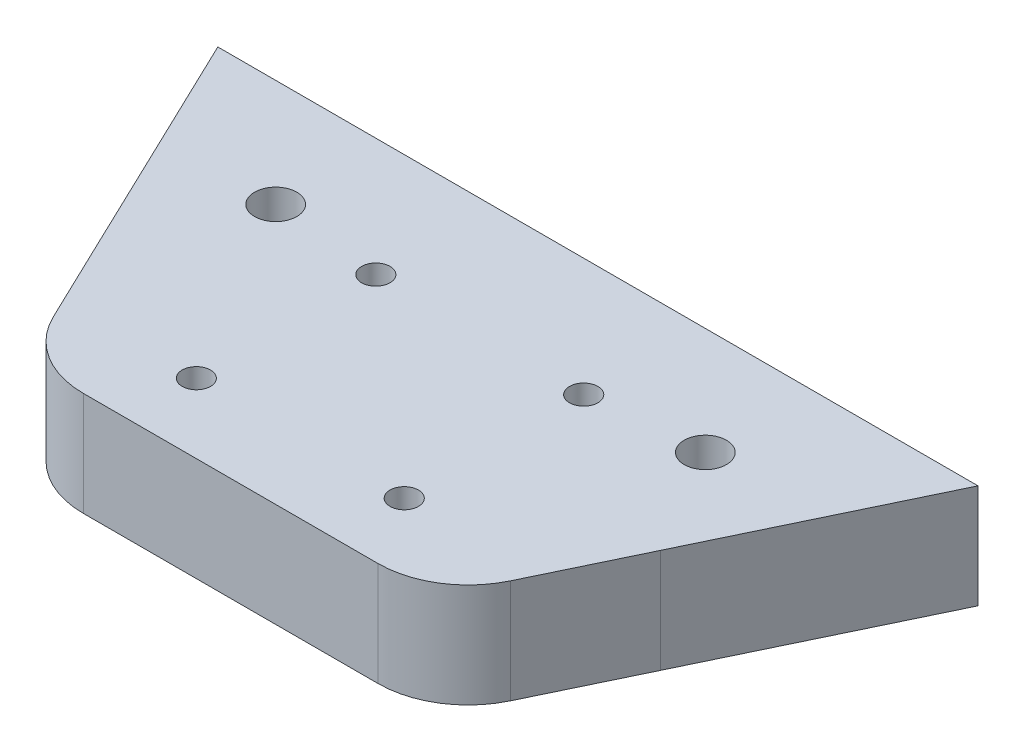
ISO-10303-21;
HEADER;
FILE_DESCRIPTION(('STEP AP214'),'2;1');
FILE_NAME('part.step','',(''),(''),'','','');
FILE_SCHEMA(('AUTOMOTIVE_DESIGN { 1 0 10303 214 1 1 1 1 }'));
ENDSEC;
DATA;
#1=APPLICATION_CONTEXT('core data for automotive mechanical design processes');
#2=APPLICATION_PROTOCOL_DEFINITION('international standard','automotive_design',2000,#1);
#3=PRODUCT_CONTEXT('',#1,'mechanical');
#4=PRODUCT('Part','Part','',(#3));
#5=PRODUCT_RELATED_PRODUCT_CATEGORY('part','',(#4));
#6=PRODUCT_DEFINITION_FORMATION('','',#4);
#7=PRODUCT_DEFINITION_CONTEXT('part definition',#1,'design');
#8=PRODUCT_DEFINITION('design','',#6,#7);
#9=PRODUCT_DEFINITION_SHAPE('','',#8);
#10=(LENGTH_UNIT() NAMED_UNIT(*) SI_UNIT(.MILLI.,.METRE.));
#11=(NAMED_UNIT(*) PLANE_ANGLE_UNIT() SI_UNIT($,.RADIAN.));
#12=(NAMED_UNIT(*) SI_UNIT($,.STERADIAN.) SOLID_ANGLE_UNIT());
#13=UNCERTAINTY_MEASURE_WITH_UNIT(LENGTH_MEASURE(1.E-05),#10,'distance_accuracy_value','');
#14=(GEOMETRIC_REPRESENTATION_CONTEXT(3) GLOBAL_UNCERTAINTY_ASSIGNED_CONTEXT((#13)) GLOBAL_UNIT_ASSIGNED_CONTEXT((#10,
#11,#12)) REPRESENTATION_CONTEXT('',''));
#15=CARTESIAN_POINT('',(0.,0.,0.));
#16=DIRECTION('',(0.,0.,1.));
#17=DIRECTION('',(1.,0.,0.));
#18=AXIS2_PLACEMENT_3D('',#15,#16,#17);
#19=CARTESIAN_POINT('',(40.,15.,15.5));
#20=DIRECTION('',(-1.,0.,0.));
#21=DIRECTION('',(0.,0.,1.));
#22=AXIS2_PLACEMENT_3D('',#19,#20,#21);
#23=PLANE('',#22);
#24=DIRECTION('',(0.,-1.,0.));
#25=VECTOR('',#24,1.);
#26=CARTESIAN_POINT('',(40.,97.9533781461747,15.482152106088));
#27=LINE('',#26,#25);
#28=CARTESIAN_POINT('',(40.,15.,15.482152106088));
#29=VERTEX_POINT('',#28);
#30=CARTESIAN_POINT('',(40.,0.,15.482152106088));
#31=VERTEX_POINT('',#30);
#32=EDGE_CURVE('E51',#29,#31,#27,.T.);
#33=ORIENTED_EDGE('',*,*,#32,.F.);
#34=DIRECTION('',(0.,0.,-1.));
#35=VECTOR('',#34,1.);
#36=CARTESIAN_POINT('',(40.,15.,15.5));
#37=LINE('',#36,#35);
#38=CARTESIAN_POINT('',(39.9957228955692,15.,15.5));
#39=VERTEX_POINT('',#38);
#40=EDGE_CURVE('E254',#39,#29,#37,.T.);
#41=ORIENTED_EDGE('',*,*,#40,.F.);
#42=CARTESIAN_POINT('',(40.,15.,15.5));
#43=DIRECTION('',(0.,-1.,0.));
#44=VECTOR('',#43,1.);
#45=LINE('',#42,#44);
#46=CARTESIAN_POINT('',(39.9957228955692,0.,15.5));
#47=VERTEX_POINT('',#46);
#48=EDGE_CURVE('E44',#39,#47,#45,.T.);
#49=ORIENTED_EDGE('',*,*,#48,.T.);
#50=DIRECTION('',(0.,0.,-1.));
#51=VECTOR('',#50,1.);
#52=CARTESIAN_POINT('',(40.,0.,15.5));
#53=LINE('',#52,#51);
#54=EDGE_CURVE('E125',#47,#31,#53,.T.);
#55=ORIENTED_EDGE('',*,*,#54,.T.);
#56=EDGE_LOOP('',(#33,#41,#49,#55));
#57=FACE_BOUND('',#56,.T.);
#58=ADVANCED_FACE('F35',(#57),#23,.F.);
#59=CARTESIAN_POINT('',(0.,15.,0.));
#60=DIRECTION('',(0.,-1.,0.));
#61=DIRECTION('',(0.,0.,-1.));
#62=AXIS2_PLACEMENT_3D('',#59,#60,#61);
#63=PLANE('',#62);
#64=CARTESIAN_POINT('',(-15.,15.,1.54999999999995));
#65=DIRECTION('',(0.,-1.,0.));
#66=DIRECTION('',(0.,0.,-1.));
#67=AXIS2_PLACEMENT_3D('',#64,#65,#66);
#68=CIRCLE('',#67,2.05);
#69=CARTESIAN_POINT('',(-15.,15.,-0.500000000000043));
#70=VERTEX_POINT('',#69);
#71=EDGE_CURVE('E136',#70,#70,#68,.T.);
#72=ORIENTED_EDGE('',*,*,#71,.T.);
#73=EDGE_LOOP('',(#72));
#74=FACE_BOUND('',#73,.T.);
#75=CARTESIAN_POINT('',(15.,15.,1.54999999999995));
#76=DIRECTION('',(0.,-1.,0.));
#77=DIRECTION('',(0.,0.,-1.));
#78=AXIS2_PLACEMENT_3D('',#75,#76,#77);
#79=CIRCLE('',#78,2.05);
#80=CARTESIAN_POINT('',(15.,15.,-0.500000000000043));
#81=VERTEX_POINT('',#80);
#82=EDGE_CURVE('E436',#81,#81,#79,.T.);
#83=ORIENTED_EDGE('',*,*,#82,.T.);
#84=EDGE_LOOP('',(#83));
#85=FACE_BOUND('',#84,.T.);
#86=ORIENTED_EDGE('',*,*,#40,.T.);
#87=DIRECTION('',(0.432206183170999,0.,-0.901774814035498));
#88=VECTOR('',#87,1.);
#89=CARTESIAN_POINT('',(38.5621224272304,15.,18.4822058565387));
#90=LINE('',#89,#88);
#91=CARTESIAN_POINT('',(54.8492478385724,15.,-15.5));
#92=VERTEX_POINT('',#91);
#93=EDGE_CURVE('E143',#29,#92,#90,.T.);
#94=ORIENTED_EDGE('',*,*,#93,.T.);
#95=DIRECTION('',(-1.,0.,0.));
#96=VECTOR('',#95,1.);
#97=CARTESIAN_POINT('',(-40.,15.,-15.5));
#98=LINE('',#97,#96);
#99=CARTESIAN_POINT('',(-54.8492478385724,15.,-15.5));
#100=VERTEX_POINT('',#99);
#101=EDGE_CURVE('E130',#92,#100,#98,.T.);
#102=ORIENTED_EDGE('',*,*,#101,.T.);
#103=DIRECTION('',(-0.432206183170999,0.,-0.901774814035498));
#104=VECTOR('',#103,1.);
#105=CARTESIAN_POINT('',(-38.5621224272304,15.,18.4822058565387));
#106=LINE('',#105,#104);
#107=CARTESIAN_POINT('',(-40.,15.,15.482152106088));
#108=VERTEX_POINT('',#107);
#109=EDGE_CURVE('E305',#108,#100,#106,.T.);
#110=ORIENTED_EDGE('',*,*,#109,.F.);
#111=DIRECTION('',(0.,0.,1.));
#112=VECTOR('',#111,1.);
#113=CARTESIAN_POINT('',(-40.,15.,15.5));
#114=LINE('',#113,#112);
#115=CARTESIAN_POINT('',(-39.9957228955692,15.,15.5));
#116=VERTEX_POINT('',#115);
#117=EDGE_CURVE('E246',#108,#116,#114,.T.);
#118=ORIENTED_EDGE('',*,*,#117,.T.);
#119=DIRECTION('',(-0.432206183170999,0.,-0.901774814035498));
#120=VECTOR('',#119,1.);
#121=CARTESIAN_POINT('',(-38.5621224272304,15.,18.4822058565387));
#122=LINE('',#121,#120);
#123=CARTESIAN_POINT('',(-32.9849471040766,15.,30.118680381223));
#124=VERTEX_POINT('',#123);
#125=EDGE_CURVE('E179',#124,#116,#122,.T.);
#126=ORIENTED_EDGE('',*,*,#125,.F.);
#127=CARTESIAN_POINT('',(-21.2618745216152,15.,24.5));
#128=DIRECTION('',(0.,-1.,0.));
#129=DIRECTION('',(0.,0.,-1.));
#130=AXIS2_PLACEMENT_3D('',#127,#128,#129);
#131=CIRCLE('',#130,13.);
#132=CARTESIAN_POINT('',(-21.2618745216152,15.,37.5));
#133=VERTEX_POINT('',#132);
#134=EDGE_CURVE('E173',#124,#133,#131,.F.);
#135=ORIENTED_EDGE('',*,*,#134,.T.);
#136=DIRECTION('',(-1.,0.,0.));
#137=VECTOR('',#136,1.);
#138=CARTESIAN_POINT('',(0.,15.,37.5));
#139=LINE('',#138,#137);
#140=CARTESIAN_POINT('',(21.2618745216151,15.,37.5));
#141=VERTEX_POINT('',#140);
#142=EDGE_CURVE('E182',#141,#133,#139,.T.);
#143=ORIENTED_EDGE('',*,*,#142,.F.);
#144=CARTESIAN_POINT('',(21.2618745216151,15.,24.5));
#145=DIRECTION('',(0.,-1.,0.));
#146=DIRECTION('',(0.,0.,-1.));
#147=AXIS2_PLACEMENT_3D('',#144,#145,#146);
#148=CIRCLE('',#147,13.);
#149=CARTESIAN_POINT('',(32.9849471040766,15.,30.118680381223));
#150=VERTEX_POINT('',#149);
#151=EDGE_CURVE('E149',#141,#150,#148,.F.);
#152=ORIENTED_EDGE('',*,*,#151,.T.);
#153=DIRECTION('',(0.432206183170999,0.,-0.901774814035498));
#154=VECTOR('',#153,1.);
#155=CARTESIAN_POINT('',(38.5621224272304,15.,18.4822058565387));
#156=LINE('',#155,#154);
#157=EDGE_CURVE('E175',#150,#39,#156,.T.);
#158=ORIENTED_EDGE('',*,*,#157,.T.);
#159=EDGE_LOOP('',(#86,#94,#102,#110,#118,#126,#135,#143,#152,#158));
#160=FACE_BOUND('',#159,.T.);
#161=CARTESIAN_POINT('',(-31.,15.,0.));
#162=DIRECTION('',(0.,1.,0.));
#163=DIRECTION('',(0.,0.,1.));
#164=AXIS2_PLACEMENT_3D('',#161,#162,#163);
#165=CIRCLE('',#164,3.05);
#166=CARTESIAN_POINT('',(-31.,15.,3.05));
#167=VERTEX_POINT('',#166);
#168=EDGE_CURVE('E266',#167,#167,#165,.T.);
#169=ORIENTED_EDGE('',*,*,#168,.F.);
#170=EDGE_LOOP('',(#169));
#171=FACE_BOUND('',#170,.T.);
#172=CARTESIAN_POINT('',(31.,15.,0.));
#173=DIRECTION('',(0.,1.,0.));
#174=DIRECTION('',(0.,0.,1.));
#175=AXIS2_PLACEMENT_3D('',#172,#173,#174);
#176=CIRCLE('',#175,3.05);
#177=CARTESIAN_POINT('',(31.,15.,3.05));
#178=VERTEX_POINT('',#177);
#179=EDGE_CURVE('E273',#178,#178,#176,.T.);
#180=ORIENTED_EDGE('',*,*,#179,.F.);
#181=EDGE_LOOP('',(#180));
#182=FACE_BOUND('',#181,.T.);
#183=CARTESIAN_POINT('',(-15.,15.,27.45));
#184=DIRECTION('',(0.,-1.,0.));
#185=DIRECTION('',(0.,0.,-1.));
#186=AXIS2_PLACEMENT_3D('',#183,#184,#185);
#187=CIRCLE('',#186,2.05);
#188=CARTESIAN_POINT('',(-15.,15.,25.4));
#189=VERTEX_POINT('',#188);
#190=EDGE_CURVE('E163',#189,#189,#187,.F.);
#191=ORIENTED_EDGE('',*,*,#190,.F.);
#192=EDGE_LOOP('',(#191));
#193=FACE_BOUND('',#192,.T.);
#194=CARTESIAN_POINT('',(15.,15.,27.45));
#195=DIRECTION('',(0.,-1.,0.));
#196=DIRECTION('',(0.,0.,-1.));
#197=AXIS2_PLACEMENT_3D('',#194,#195,#196);
#198=CIRCLE('',#197,2.05);
#199=CARTESIAN_POINT('',(15.,15.,25.4));
#200=VERTEX_POINT('',#199);
#201=EDGE_CURVE('E164',#200,#200,#198,.F.);
#202=ORIENTED_EDGE('',*,*,#201,.F.);
#203=EDGE_LOOP('',(#202));
#204=FACE_BOUND('',#203,.T.);
#205=ADVANCED_FACE('F229',(#74,#85,#160,#171,#182,#193,#204),#63,.F.);
#206=CARTESIAN_POINT('',(0.,0.,0.));
#207=DIRECTION('',(0.,-1.,0.));
#208=DIRECTION('',(0.,0.,-1.));
#209=AXIS2_PLACEMENT_3D('',#206,#207,#208);
#210=PLANE('',#209);
#211=CARTESIAN_POINT('',(-15.,0.,1.54999999999995));
#212=DIRECTION('',(0.,-1.,0.));
#213=DIRECTION('',(0.,0.,-1.));
#214=AXIS2_PLACEMENT_3D('',#211,#212,#213);
#215=CIRCLE('',#214,2.05);
#216=CARTESIAN_POINT('',(-15.,0.,-0.500000000000043));
#217=VERTEX_POINT('',#216);
#218=EDGE_CURVE('E139',#217,#217,#215,.T.);
#219=ORIENTED_EDGE('',*,*,#218,.F.);
#220=EDGE_LOOP('',(#219));
#221=FACE_BOUND('',#220,.T.);
#222=CARTESIAN_POINT('',(15.,0.,1.54999999999995));
#223=DIRECTION('',(0.,-1.,0.));
#224=DIRECTION('',(0.,0.,-1.));
#225=AXIS2_PLACEMENT_3D('',#222,#223,#224);
#226=CIRCLE('',#225,2.05);
#227=CARTESIAN_POINT('',(15.,0.,-0.500000000000043));
#228=VERTEX_POINT('',#227);
#229=EDGE_CURVE('E439',#228,#228,#226,.T.);
#230=ORIENTED_EDGE('',*,*,#229,.F.);
#231=EDGE_LOOP('',(#230));
#232=FACE_BOUND('',#231,.T.);
#233=CARTESIAN_POINT('',(-31.,0.,0.));
#234=DIRECTION('',(0.,1.,0.));
#235=DIRECTION('',(0.,0.,1.));
#236=AXIS2_PLACEMENT_3D('',#233,#234,#235);
#237=CIRCLE('',#236,3.05);
#238=CARTESIAN_POINT('',(-31.,0.,3.05));
#239=VERTEX_POINT('',#238);
#240=EDGE_CURVE('E269',#239,#239,#237,.T.);
#241=ORIENTED_EDGE('',*,*,#240,.T.);
#242=EDGE_LOOP('',(#241));
#243=FACE_BOUND('',#242,.T.);
#244=ORIENTED_EDGE('',*,*,#54,.F.);
#245=DIRECTION('',(-0.432206183170999,0.,0.901774814035498));
#246=VECTOR('',#245,1.);
#247=CARTESIAN_POINT('',(38.5621224272304,0.,18.4822058565387));
#248=LINE('',#247,#246);
#249=CARTESIAN_POINT('',(32.9849471040766,0.,30.118680381223));
#250=VERTEX_POINT('',#249);
#251=EDGE_CURVE('E150',#47,#250,#248,.T.);
#252=ORIENTED_EDGE('',*,*,#251,.T.);
#253=CARTESIAN_POINT('',(21.2618745216151,0.,24.5));
#254=DIRECTION('',(0.,-1.,0.));
#255=DIRECTION('',(0.,0.,-1.));
#256=AXIS2_PLACEMENT_3D('',#253,#254,#255);
#257=CIRCLE('',#256,13.);
#258=CARTESIAN_POINT('',(21.2618745216151,0.,37.5));
#259=VERTEX_POINT('',#258);
#260=EDGE_CURVE('E146',#250,#259,#257,.T.);
#261=ORIENTED_EDGE('',*,*,#260,.T.);
#262=DIRECTION('',(1.,0.,0.));
#263=VECTOR('',#262,1.);
#264=CARTESIAN_POINT('',(0.,0.,37.5));
#265=LINE('',#264,#263);
#266=CARTESIAN_POINT('',(-21.2618745216152,0.,37.5));
#267=VERTEX_POINT('',#266);
#268=EDGE_CURVE('E155',#267,#259,#265,.T.);
#269=ORIENTED_EDGE('',*,*,#268,.F.);
#270=CARTESIAN_POINT('',(-21.2618745216152,0.,24.5));
#271=DIRECTION('',(0.,-1.,0.));
#272=DIRECTION('',(0.,0.,-1.));
#273=AXIS2_PLACEMENT_3D('',#270,#271,#272);
#274=CIRCLE('',#273,13.);
#275=CARTESIAN_POINT('',(-32.9849471040766,0.,30.118680381223));
#276=VERTEX_POINT('',#275);
#277=EDGE_CURVE('E151',#267,#276,#274,.T.);
#278=ORIENTED_EDGE('',*,*,#277,.T.);
#279=DIRECTION('',(0.432206183170999,0.,0.901774814035498));
#280=VECTOR('',#279,1.);
#281=CARTESIAN_POINT('',(-38.5621224272304,0.,18.4822058565387));
#282=LINE('',#281,#280);
#283=CARTESIAN_POINT('',(-39.9957228955692,0.,15.5));
#284=VERTEX_POINT('',#283);
#285=EDGE_CURVE('E170',#284,#276,#282,.T.);
#286=ORIENTED_EDGE('',*,*,#285,.F.);
#287=DIRECTION('',(0.,0.,1.));
#288=VECTOR('',#287,1.);
#289=CARTESIAN_POINT('',(-40.,0.,15.5));
#290=LINE('',#289,#288);
#291=CARTESIAN_POINT('',(-40.,0.,15.482152106088));
#292=VERTEX_POINT('',#291);
#293=EDGE_CURVE('E124',#292,#284,#290,.T.);
#294=ORIENTED_EDGE('',*,*,#293,.F.);
#295=DIRECTION('',(0.432206183170999,0.,0.901774814035498));
#296=VECTOR('',#295,1.);
#297=CARTESIAN_POINT('',(-38.5621224272304,0.,18.4822058565387));
#298=LINE('',#297,#296);
#299=CARTESIAN_POINT('',(-54.8492478385724,0.,-15.5));
#300=VERTEX_POINT('',#299);
#301=EDGE_CURVE('E59',#300,#292,#298,.T.);
#302=ORIENTED_EDGE('',*,*,#301,.F.);
#303=DIRECTION('',(-1.,0.,0.));
#304=VECTOR('',#303,1.);
#305=CARTESIAN_POINT('',(-40.,0.,-15.5));
#306=LINE('',#305,#304);
#307=CARTESIAN_POINT('',(54.8492478385724,0.,-15.5));
#308=VERTEX_POINT('',#307);
#309=EDGE_CURVE('E114',#308,#300,#306,.T.);
#310=ORIENTED_EDGE('',*,*,#309,.F.);
#311=DIRECTION('',(-0.432206183170999,0.,0.901774814035498));
#312=VECTOR('',#311,1.);
#313=CARTESIAN_POINT('',(38.5621224272304,0.,18.4822058565387));
#314=LINE('',#313,#312);
#315=EDGE_CURVE('E120',#308,#31,#314,.T.);
#316=ORIENTED_EDGE('',*,*,#315,.T.);
#317=EDGE_LOOP('',(#244,#252,#261,#269,#278,#286,#294,#302,#310,#316));
#318=FACE_BOUND('',#317,.T.);
#319=CARTESIAN_POINT('',(31.,0.,0.));
#320=DIRECTION('',(0.,1.,0.));
#321=DIRECTION('',(0.,0.,1.));
#322=AXIS2_PLACEMENT_3D('',#319,#320,#321);
#323=CIRCLE('',#322,3.05);
#324=CARTESIAN_POINT('',(31.,0.,3.05));
#325=VERTEX_POINT('',#324);
#326=EDGE_CURVE('E276',#325,#325,#323,.T.);
#327=ORIENTED_EDGE('',*,*,#326,.T.);
#328=EDGE_LOOP('',(#327));
#329=FACE_BOUND('',#328,.T.);
#330=CARTESIAN_POINT('',(-15.,0.,27.45));
#331=DIRECTION('',(0.,-1.,0.));
#332=DIRECTION('',(0.,0.,-1.));
#333=AXIS2_PLACEMENT_3D('',#330,#331,#332);
#334=CIRCLE('',#333,2.05);
#335=CARTESIAN_POINT('',(-15.,0.,25.4));
#336=VERTEX_POINT('',#335);
#337=EDGE_CURVE('E165',#336,#336,#334,.T.);
#338=ORIENTED_EDGE('',*,*,#337,.F.);
#339=EDGE_LOOP('',(#338));
#340=FACE_BOUND('',#339,.T.);
#341=CARTESIAN_POINT('',(15.,0.,27.45));
#342=DIRECTION('',(0.,-1.,0.));
#343=DIRECTION('',(0.,0.,-1.));
#344=AXIS2_PLACEMENT_3D('',#341,#342,#343);
#345=CIRCLE('',#344,2.05);
#346=CARTESIAN_POINT('',(15.,0.,25.4));
#347=VERTEX_POINT('',#346);
#348=EDGE_CURVE('E160',#347,#347,#345,.T.);
#349=ORIENTED_EDGE('',*,*,#348,.F.);
#350=EDGE_LOOP('',(#349));
#351=FACE_BOUND('',#350,.T.);
#352=ADVANCED_FACE('F117',(#221,#232,#243,#318,#329,#340,#351),#210,.T.);
#353=CARTESIAN_POINT('',(-40.,15.,-15.5));
#354=DIRECTION('',(0.,0.,1.));
#355=DIRECTION('',(1.,0.,0.));
#356=AXIS2_PLACEMENT_3D('',#353,#354,#355);
#357=PLANE('',#356);
#358=ORIENTED_EDGE('',*,*,#309,.T.);
#359=DIRECTION('',(0.,-1.,0.));
#360=VECTOR('',#359,1.);
#361=CARTESIAN_POINT('',(-54.8492478385724,97.9533781461747,-15.5));
#362=LINE('',#361,#360);
#363=EDGE_CURVE('E308',#100,#300,#362,.T.);
#364=ORIENTED_EDGE('',*,*,#363,.F.);
#365=ORIENTED_EDGE('',*,*,#101,.F.);
#366=DIRECTION('',(0.,-1.,0.));
#367=VECTOR('',#366,1.);
#368=CARTESIAN_POINT('',(54.8492478385724,97.9533781461747,-15.5));
#369=LINE('',#368,#367);
#370=EDGE_CURVE('E128',#92,#308,#369,.T.);
#371=ORIENTED_EDGE('',*,*,#370,.T.);
#372=EDGE_LOOP('',(#358,#364,#365,#371));
#373=FACE_BOUND('',#372,.T.);
#374=ADVANCED_FACE('F129',(#373),#357,.F.);
#375=CARTESIAN_POINT('',(-40.,15.,15.5));
#376=DIRECTION('',(1.,0.,0.));
#377=DIRECTION('',(0.,0.,-1.));
#378=AXIS2_PLACEMENT_3D('',#375,#376,#377);
#379=PLANE('',#378);
#380=ORIENTED_EDGE('',*,*,#117,.F.);
#381=DIRECTION('',(0.,-1.,0.));
#382=VECTOR('',#381,1.);
#383=CARTESIAN_POINT('',(-40.,97.9533781461747,15.482152106088));
#384=LINE('',#383,#382);
#385=EDGE_CURVE('E310',#108,#292,#384,.T.);
#386=ORIENTED_EDGE('',*,*,#385,.T.);
#387=ORIENTED_EDGE('',*,*,#293,.T.);
#388=CARTESIAN_POINT('',(-39.9914457911384,15.,15.5));
#389=DIRECTION('',(0.,-1.,0.));
#390=VECTOR('',#389,1.);
#391=LINE('',#388,#390);
#392=EDGE_CURVE('E11',#116,#284,#391,.T.);
#393=ORIENTED_EDGE('',*,*,#392,.F.);
#394=EDGE_LOOP('',(#380,#386,#387,#393));
#395=FACE_BOUND('',#394,.T.);
#396=ADVANCED_FACE('F227',(#395),#379,.F.);
#397=CARTESIAN_POINT('',(-31.,15.,0.));
#398=DIRECTION('',(0.,-1.,0.));
#399=DIRECTION('',(0.,0.,-1.));
#400=AXIS2_PLACEMENT_3D('',#397,#398,#399);
#401=CYLINDRICAL_SURFACE('',#400,3.05);
#402=ORIENTED_EDGE('',*,*,#168,.T.);
#403=EDGE_LOOP('',(#402));
#404=FACE_BOUND('',#403,.T.);
#405=ORIENTED_EDGE('',*,*,#240,.F.);
#406=EDGE_LOOP('',(#405));
#407=FACE_BOUND('',#406,.T.);
#408=ADVANCED_FACE('F223',(#404,#407),#401,.F.);
#409=CARTESIAN_POINT('',(31.,15.,0.));
#410=DIRECTION('',(0.,-1.,0.));
#411=DIRECTION('',(0.,0.,-1.));
#412=AXIS2_PLACEMENT_3D('',#409,#410,#411);
#413=CYLINDRICAL_SURFACE('',#412,3.05);
#414=ORIENTED_EDGE('',*,*,#179,.T.);
#415=EDGE_LOOP('',(#414));
#416=FACE_BOUND('',#415,.T.);
#417=ORIENTED_EDGE('',*,*,#326,.F.);
#418=EDGE_LOOP('',(#417));
#419=FACE_BOUND('',#418,.T.);
#420=ADVANCED_FACE('F220',(#416,#419),#413,.F.);
#421=CARTESIAN_POINT('',(-38.5621224272304,97.9533781461747,18.4822058565387));
#422=DIRECTION('',(0.901774814035498,0.,-0.432206183170999));
#423=DIRECTION('',(-0.432206183170999,0.,-0.901774814035498));
#424=AXIS2_PLACEMENT_3D('',#421,#422,#423);
#425=PLANE('',#424);
#426=ORIENTED_EDGE('',*,*,#385,.F.);
#427=ORIENTED_EDGE('',*,*,#109,.T.);
#428=ORIENTED_EDGE('',*,*,#363,.T.);
#429=ORIENTED_EDGE('',*,*,#301,.T.);
#430=EDGE_LOOP('',(#426,#427,#428,#429));
#431=FACE_BOUND('',#430,.T.);
#432=ADVANCED_FACE('F216',(#431),#425,.F.);
#433=CARTESIAN_POINT('',(0.,97.9533781461747,37.5));
#434=DIRECTION('',(0.,0.,-1.));
#435=DIRECTION('',(-1.,0.,0.));
#436=AXIS2_PLACEMENT_3D('',#433,#434,#435);
#437=PLANE('',#436);
#438=DIRECTION('',(0.,-1.,0.));
#439=VECTOR('',#438,1.);
#440=CARTESIAN_POINT('',(21.2618745216151,97.9533781461747,37.5));
#441=LINE('',#440,#439);
#442=EDGE_CURVE('E158',#141,#259,#441,.T.);
#443=ORIENTED_EDGE('',*,*,#442,.F.);
#444=ORIENTED_EDGE('',*,*,#142,.T.);
#445=DIRECTION('',(0.,-1.,0.));
#446=VECTOR('',#445,1.);
#447=CARTESIAN_POINT('',(-21.2618745216152,97.9533781461747,37.5));
#448=LINE('',#447,#446);
#449=EDGE_CURVE('E159',#133,#267,#448,.T.);
#450=ORIENTED_EDGE('',*,*,#449,.T.);
#451=ORIENTED_EDGE('',*,*,#268,.T.);
#452=EDGE_LOOP('',(#443,#444,#450,#451));
#453=FACE_BOUND('',#452,.T.);
#454=ADVANCED_FACE('F212',(#453),#437,.F.);
#455=CARTESIAN_POINT('',(21.2618745216151,97.9533781461747,24.5));
#456=DIRECTION('',(0.,-1.,0.));
#457=DIRECTION('',(0.,0.,-1.));
#458=AXIS2_PLACEMENT_3D('',#455,#456,#457);
#459=CYLINDRICAL_SURFACE('',#458,13.);
#460=ORIENTED_EDGE('',*,*,#151,.F.);
#461=ORIENTED_EDGE('',*,*,#442,.T.);
#462=ORIENTED_EDGE('',*,*,#260,.F.);
#463=DIRECTION('',(0.,-1.,0.));
#464=VECTOR('',#463,1.);
#465=CARTESIAN_POINT('',(32.9849471040766,97.9533781461747,30.118680381223));
#466=LINE('',#465,#464);
#467=EDGE_CURVE('E177',#150,#250,#466,.T.);
#468=ORIENTED_EDGE('',*,*,#467,.F.);
#469=EDGE_LOOP('',(#460,#461,#462,#468));
#470=FACE_BOUND('',#469,.T.);
#471=ADVANCED_FACE('F207',(#470),#459,.T.);
#472=CARTESIAN_POINT('',(38.5621224272304,97.9533781461747,18.4822058565387));
#473=DIRECTION('',(0.901774814035498,0.,0.432206183170999));
#474=DIRECTION('',(0.432206183170999,0.,-0.901774814035498));
#475=AXIS2_PLACEMENT_3D('',#472,#473,#474);
#476=PLANE('',#475);
#477=ORIENTED_EDGE('',*,*,#157,.F.);
#478=ORIENTED_EDGE('',*,*,#467,.T.);
#479=ORIENTED_EDGE('',*,*,#251,.F.);
#480=ORIENTED_EDGE('',*,*,#48,.F.);
#481=EDGE_LOOP('',(#477,#478,#479,#480));
#482=FACE_BOUND('',#481,.T.);
#483=ADVANCED_FACE('F196',(#482),#476,.T.);
#484=CARTESIAN_POINT('',(-38.5621224272304,97.9533781461747,18.4822058565387));
#485=DIRECTION('',(0.901774814035498,0.,-0.432206183170999));
#486=DIRECTION('',(-0.432206183170999,0.,-0.901774814035498));
#487=AXIS2_PLACEMENT_3D('',#484,#485,#486);
#488=PLANE('',#487);
#489=DIRECTION('',(0.,-1.,0.));
#490=VECTOR('',#489,1.);
#491=CARTESIAN_POINT('',(-32.9849471040766,97.9533781461747,30.118680381223));
#492=LINE('',#491,#490);
#493=EDGE_CURVE('E154',#124,#276,#492,.T.);
#494=ORIENTED_EDGE('',*,*,#493,.F.);
#495=ORIENTED_EDGE('',*,*,#125,.T.);
#496=ORIENTED_EDGE('',*,*,#392,.T.);
#497=ORIENTED_EDGE('',*,*,#285,.T.);
#498=EDGE_LOOP('',(#494,#495,#496,#497));
#499=FACE_BOUND('',#498,.T.);
#500=ADVANCED_FACE('F206',(#499),#488,.F.);
#501=CARTESIAN_POINT('',(15.,97.9533781461747,27.45));
#502=DIRECTION('',(0.,-1.,0.));
#503=DIRECTION('',(0.,0.,-1.));
#504=AXIS2_PLACEMENT_3D('',#501,#502,#503);
#505=CYLINDRICAL_SURFACE('',#504,2.05);
#506=ORIENTED_EDGE('',*,*,#201,.T.);
#507=EDGE_LOOP('',(#506));
#508=FACE_BOUND('',#507,.T.);
#509=ORIENTED_EDGE('',*,*,#348,.T.);
#510=EDGE_LOOP('',(#509));
#511=FACE_BOUND('',#510,.T.);
#512=ADVANCED_FACE('F322',(#508,#511),#505,.F.);
#513=CARTESIAN_POINT('',(-15.,97.9533781461747,27.45));
#514=DIRECTION('',(0.,-1.,0.));
#515=DIRECTION('',(0.,0.,-1.));
#516=AXIS2_PLACEMENT_3D('',#513,#514,#515);
#517=CYLINDRICAL_SURFACE('',#516,2.05);
#518=ORIENTED_EDGE('',*,*,#190,.T.);
#519=EDGE_LOOP('',(#518));
#520=FACE_BOUND('',#519,.T.);
#521=ORIENTED_EDGE('',*,*,#337,.T.);
#522=EDGE_LOOP('',(#521));
#523=FACE_BOUND('',#522,.T.);
#524=ADVANCED_FACE('F324',(#520,#523),#517,.F.);
#525=CARTESIAN_POINT('',(-21.2618745216152,97.9533781461747,24.5));
#526=DIRECTION('',(0.,-1.,0.));
#527=DIRECTION('',(0.,0.,-1.));
#528=AXIS2_PLACEMENT_3D('',#525,#526,#527);
#529=CYLINDRICAL_SURFACE('',#528,13.);
#530=ORIENTED_EDGE('',*,*,#134,.F.);
#531=ORIENTED_EDGE('',*,*,#493,.T.);
#532=ORIENTED_EDGE('',*,*,#277,.F.);
#533=ORIENTED_EDGE('',*,*,#449,.F.);
#534=EDGE_LOOP('',(#530,#531,#532,#533));
#535=FACE_BOUND('',#534,.T.);
#536=ADVANCED_FACE('F331',(#535),#529,.T.);
#537=CARTESIAN_POINT('',(38.5621224272304,97.9533781461747,18.4822058565387));
#538=DIRECTION('',(0.901774814035498,0.,0.432206183170999));
#539=DIRECTION('',(0.432206183170999,0.,-0.901774814035498));
#540=AXIS2_PLACEMENT_3D('',#537,#538,#539);
#541=PLANE('',#540);
#542=ORIENTED_EDGE('',*,*,#93,.F.);
#543=ORIENTED_EDGE('',*,*,#32,.T.);
#544=ORIENTED_EDGE('',*,*,#315,.F.);
#545=ORIENTED_EDGE('',*,*,#370,.F.);
#546=EDGE_LOOP('',(#542,#543,#544,#545));
#547=FACE_BOUND('',#546,.T.);
#548=ADVANCED_FACE('F135',(#547),#541,.T.);
#549=CARTESIAN_POINT('',(15.,15.,1.54999999999995));
#550=DIRECTION('',(0.,-1.,0.));
#551=DIRECTION('',(0.,0.,-1.));
#552=AXIS2_PLACEMENT_3D('',#549,#550,#551);
#553=CYLINDRICAL_SURFACE('',#552,2.05);
#554=ORIENTED_EDGE('',*,*,#82,.F.);
#555=EDGE_LOOP('',(#554));
#556=FACE_BOUND('',#555,.T.);
#557=ORIENTED_EDGE('',*,*,#229,.T.);
#558=EDGE_LOOP('',(#557));
#559=FACE_BOUND('',#558,.T.);
#560=ADVANCED_FACE('F410',(#556,#559),#553,.F.);
#561=CARTESIAN_POINT('',(-15.,15.,1.54999999999995));
#562=DIRECTION('',(0.,-1.,0.));
#563=DIRECTION('',(0.,0.,-1.));
#564=AXIS2_PLACEMENT_3D('',#561,#562,#563);
#565=CYLINDRICAL_SURFACE('',#564,2.05);
#566=ORIENTED_EDGE('',*,*,#71,.F.);
#567=EDGE_LOOP('',(#566));
#568=FACE_BOUND('',#567,.T.);
#569=ORIENTED_EDGE('',*,*,#218,.T.);
#570=EDGE_LOOP('',(#569));
#571=FACE_BOUND('',#570,.T.);
#572=ADVANCED_FACE('F418',(#568,#571),#565,.F.);
#573=CLOSED_SHELL('',(#58,#205,#352,#374,#396,#408,#420,#432,#454,#471,#483,#500,#512,#524,#536,
#548,#560,#572));
#574=MANIFOLD_SOLID_BREP('B2',#573);
#575=ADVANCED_BREP_SHAPE_REPRESENTATION('',(#18,#574),#14);
#576=SHAPE_DEFINITION_REPRESENTATION(#9,#575);
ENDSEC;
END-ISO-10303-21;
